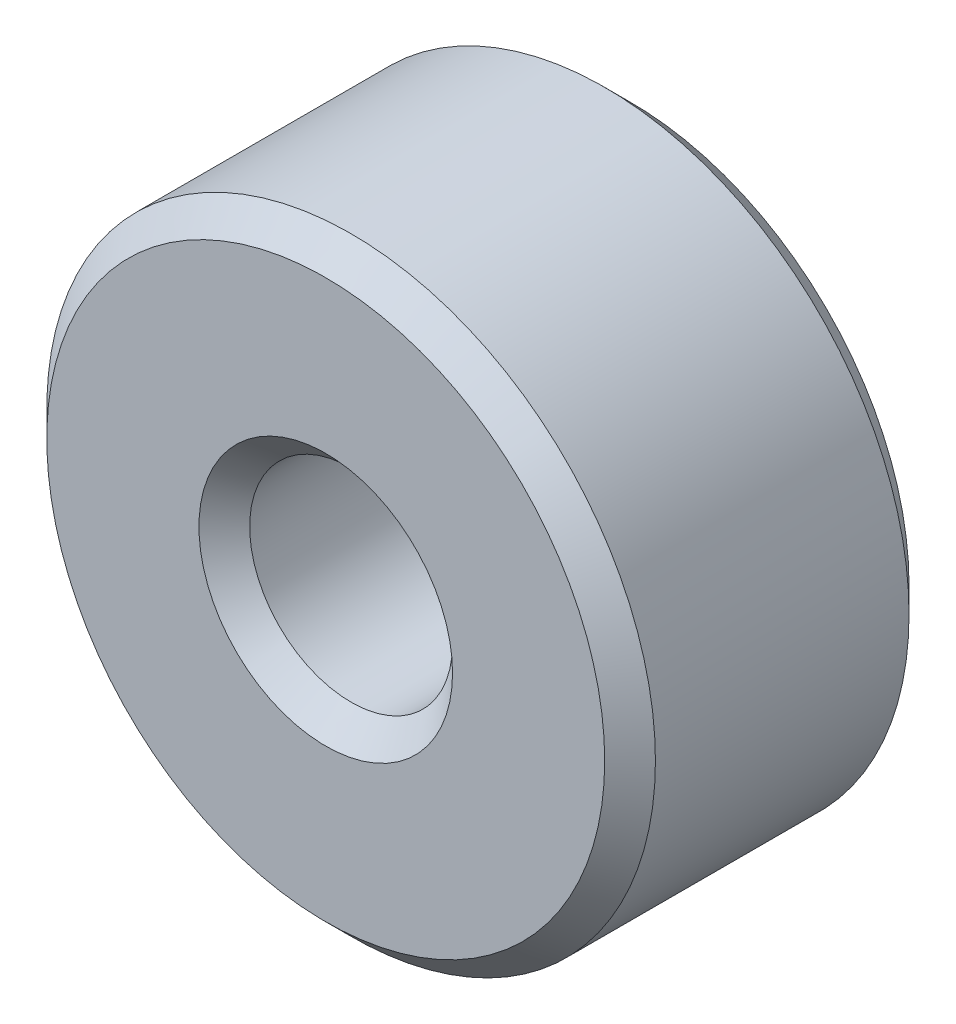
ISO-10303-21;
HEADER;
FILE_DESCRIPTION(('STEP AP214'),'2;1');
FILE_NAME('part.step','',(''),(''),'','','');
FILE_SCHEMA(('AUTOMOTIVE_DESIGN { 1 0 10303 214 1 1 1 1 }'));
ENDSEC;
DATA;
#1=APPLICATION_CONTEXT('core data for automotive mechanical design processes');
#2=APPLICATION_PROTOCOL_DEFINITION('international standard','automotive_design',2000,#1);
#3=PRODUCT_CONTEXT('',#1,'mechanical');
#4=PRODUCT('Part','Part','',(#3));
#5=PRODUCT_RELATED_PRODUCT_CATEGORY('part','',(#4));
#6=PRODUCT_DEFINITION_FORMATION('','',#4);
#7=PRODUCT_DEFINITION_CONTEXT('part definition',#1,'design');
#8=PRODUCT_DEFINITION('design','',#6,#7);
#9=PRODUCT_DEFINITION_SHAPE('','',#8);
#10=(LENGTH_UNIT() NAMED_UNIT(*) SI_UNIT(.MILLI.,.METRE.));
#11=(NAMED_UNIT(*) PLANE_ANGLE_UNIT() SI_UNIT($,.RADIAN.));
#12=(NAMED_UNIT(*) SI_UNIT($,.STERADIAN.) SOLID_ANGLE_UNIT());
#13=UNCERTAINTY_MEASURE_WITH_UNIT(LENGTH_MEASURE(1.E-05),#10,'distance_accuracy_value','');
#14=(GEOMETRIC_REPRESENTATION_CONTEXT(3) GLOBAL_UNCERTAINTY_ASSIGNED_CONTEXT((#13)) GLOBAL_UNIT_ASSIGNED_CONTEXT((#10,
#11,#12)) REPRESENTATION_CONTEXT('',''));
#15=CARTESIAN_POINT('',(0.,0.,0.));
#16=DIRECTION('',(0.,0.,1.));
#17=DIRECTION('',(1.,0.,0.));
#18=AXIS2_PLACEMENT_3D('',#15,#16,#17);
#19=CARTESIAN_POINT('',(0.,0.,3.));
#20=DIRECTION('',(0.,0.,1.));
#21=DIRECTION('',(1.,0.,0.));
#22=AXIS2_PLACEMENT_3D('',#19,#20,#21);
#23=PLANE('',#22);
#24=CARTESIAN_POINT('',(0.,0.,3.));
#25=DIRECTION('',(0.,0.,1.));
#26=DIRECTION('',(1.,0.,0.));
#27=AXIS2_PLACEMENT_3D('',#24,#25,#26);
#28=CIRCLE('',#27,1.25);
#29=CARTESIAN_POINT('',(1.25,0.,3.));
#30=VERTEX_POINT('',#29);
#31=EDGE_CURVE('E11',#30,#30,#28,.F.);
#32=ORIENTED_EDGE('',*,*,#31,.T.);
#33=EDGE_LOOP('',(#32));
#34=FACE_BOUND('',#33,.T.);
#35=CARTESIAN_POINT('',(0.,0.,3.));
#36=DIRECTION('',(0.,0.,1.));
#37=DIRECTION('',(1.,0.,0.));
#38=AXIS2_PLACEMENT_3D('',#35,#36,#37);
#39=CIRCLE('',#38,2.75);
#40=CARTESIAN_POINT('',(2.75,0.,3.));
#41=VERTEX_POINT('',#40);
#42=EDGE_CURVE('E57',#41,#41,#39,.T.);
#43=ORIENTED_EDGE('',*,*,#42,.T.);
#44=EDGE_LOOP('',(#43));
#45=FACE_BOUND('',#44,.T.);
#46=ADVANCED_FACE('F49',(#34,#45),#23,.T.);
#47=CARTESIAN_POINT('',(0.,0.,0.));
#48=DIRECTION('',(0.,0.,1.));
#49=DIRECTION('',(1.,0.,0.));
#50=AXIS2_PLACEMENT_3D('',#47,#48,#49);
#51=PLANE('',#50);
#52=CARTESIAN_POINT('',(0.,0.,0.));
#53=DIRECTION('',(0.,0.,1.));
#54=DIRECTION('',(1.,0.,0.));
#55=AXIS2_PLACEMENT_3D('',#52,#53,#54);
#56=CIRCLE('',#55,1.25);
#57=CARTESIAN_POINT('',(1.25,0.,0.));
#58=VERTEX_POINT('',#57);
#59=EDGE_CURVE('E76',#58,#58,#56,.T.);
#60=ORIENTED_EDGE('',*,*,#59,.T.);
#61=EDGE_LOOP('',(#60));
#62=FACE_BOUND('',#61,.T.);
#63=CARTESIAN_POINT('',(0.,0.,0.));
#64=DIRECTION('',(0.,0.,1.));
#65=DIRECTION('',(1.,0.,0.));
#66=AXIS2_PLACEMENT_3D('',#63,#64,#65);
#67=CIRCLE('',#66,2.75);
#68=CARTESIAN_POINT('',(2.75,0.,0.));
#69=VERTEX_POINT('',#68);
#70=EDGE_CURVE('E79',#69,#69,#67,.F.);
#71=ORIENTED_EDGE('',*,*,#70,.T.);
#72=EDGE_LOOP('',(#71));
#73=FACE_BOUND('',#72,.T.);
#74=ADVANCED_FACE('F83',(#62,#73),#51,.F.);
#75=CARTESIAN_POINT('',(0.,0.,3.));
#76=DIRECTION('',(0.,0.,-1.));
#77=DIRECTION('',(-1.,0.,0.));
#78=AXIS2_PLACEMENT_3D('',#75,#76,#77);
#79=CYLINDRICAL_SURFACE('',#78,3.);
#80=CARTESIAN_POINT('',(0.,0.,0.250000000000001));
#81=DIRECTION('',(0.,0.,1.));
#82=DIRECTION('',(1.,0.,0.));
#83=AXIS2_PLACEMENT_3D('',#80,#81,#82);
#84=CIRCLE('',#83,3.);
#85=CARTESIAN_POINT('',(3.,0.,0.250000000000001));
#86=VERTEX_POINT('',#85);
#87=EDGE_CURVE('E61',#86,#86,#84,.T.);
#88=ORIENTED_EDGE('',*,*,#87,.T.);
#89=EDGE_LOOP('',(#88));
#90=FACE_BOUND('',#89,.T.);
#91=CARTESIAN_POINT('',(0.,0.,2.75));
#92=DIRECTION('',(0.,0.,1.));
#93=DIRECTION('',(1.,0.,0.));
#94=AXIS2_PLACEMENT_3D('',#91,#92,#93);
#95=CIRCLE('',#94,3.);
#96=CARTESIAN_POINT('',(3.,0.,2.75));
#97=VERTEX_POINT('',#96);
#98=EDGE_CURVE('E65',#97,#97,#95,.F.);
#99=ORIENTED_EDGE('',*,*,#98,.T.);
#100=EDGE_LOOP('',(#99));
#101=FACE_BOUND('',#100,.T.);
#102=ADVANCED_FACE('F93',(#90,#101),#79,.T.);
#103=CARTESIAN_POINT('',(0.,0.,3.));
#104=DIRECTION('',(0.,0.,-1.));
#105=DIRECTION('',(-1.,0.,0.));
#106=AXIS2_PLACEMENT_3D('',#103,#104,#105);
#107=CYLINDRICAL_SURFACE('',#106,1.);
#108=CARTESIAN_POINT('',(0.,0.,0.250000000000001));
#109=DIRECTION('',(0.,0.,1.));
#110=DIRECTION('',(1.,0.,0.));
#111=AXIS2_PLACEMENT_3D('',#108,#109,#110);
#112=CIRCLE('',#111,1.);
#113=CARTESIAN_POINT('',(1.,0.,0.250000000000001));
#114=VERTEX_POINT('',#113);
#115=EDGE_CURVE('E70',#114,#114,#112,.F.);
#116=ORIENTED_EDGE('',*,*,#115,.T.);
#117=EDGE_LOOP('',(#116));
#118=FACE_BOUND('',#117,.T.);
#119=CARTESIAN_POINT('',(0.,0.,2.75));
#120=DIRECTION('',(0.,0.,1.));
#121=DIRECTION('',(1.,0.,0.));
#122=AXIS2_PLACEMENT_3D('',#119,#120,#121);
#123=CIRCLE('',#122,1.);
#124=CARTESIAN_POINT('',(1.,0.,2.75));
#125=VERTEX_POINT('',#124);
#126=EDGE_CURVE('E73',#125,#125,#123,.T.);
#127=ORIENTED_EDGE('',*,*,#126,.T.);
#128=EDGE_LOOP('',(#127));
#129=FACE_BOUND('',#128,.T.);
#130=ADVANCED_FACE('F96',(#118,#129),#107,.F.);
#131=CARTESIAN_POINT('',(0.,0.,0.));
#132=DIRECTION('',(0.,0.,-1.));
#133=DIRECTION('',(-1.,0.,0.));
#134=AXIS2_PLACEMENT_3D('',#131,#132,#133);
#135=CONICAL_SURFACE('',#134,1.25,0.785398163397446);
#136=ORIENTED_EDGE('',*,*,#115,.F.);
#137=EDGE_LOOP('',(#136));
#138=FACE_BOUND('',#137,.T.);
#139=ORIENTED_EDGE('',*,*,#59,.F.);
#140=EDGE_LOOP('',(#139));
#141=FACE_BOUND('',#140,.T.);
#142=ADVANCED_FACE('F89',(#138,#141),#135,.F.);
#143=CARTESIAN_POINT('',(0.,0.,0.250000000000001));
#144=DIRECTION('',(0.,0.,1.));
#145=DIRECTION('',(1.,0.,0.));
#146=AXIS2_PLACEMENT_3D('',#143,#144,#145);
#147=CONICAL_SURFACE('',#146,3.,0.78539816339745);
#148=ORIENTED_EDGE('',*,*,#70,.F.);
#149=EDGE_LOOP('',(#148));
#150=FACE_BOUND('',#149,.T.);
#151=ORIENTED_EDGE('',*,*,#87,.F.);
#152=EDGE_LOOP('',(#151));
#153=FACE_BOUND('',#152,.T.);
#154=ADVANCED_FACE('F85',(#150,#153),#147,.T.);
#155=CARTESIAN_POINT('',(0.,0.,2.75));
#156=DIRECTION('',(0.,0.,1.));
#157=DIRECTION('',(1.,0.,0.));
#158=AXIS2_PLACEMENT_3D('',#155,#156,#157);
#159=CONICAL_SURFACE('',#158,1.,0.78539816339745);
#160=ORIENTED_EDGE('',*,*,#31,.F.);
#161=EDGE_LOOP('',(#160));
#162=FACE_BOUND('',#161,.T.);
#163=ORIENTED_EDGE('',*,*,#126,.F.);
#164=EDGE_LOOP('',(#163));
#165=FACE_BOUND('',#164,.T.);
#166=ADVANCED_FACE('F88',(#162,#165),#159,.F.);
#167=CARTESIAN_POINT('',(0.,0.,3.));
#168=DIRECTION('',(0.,0.,-1.));
#169=DIRECTION('',(-1.,0.,0.));
#170=AXIS2_PLACEMENT_3D('',#167,#168,#169);
#171=CONICAL_SURFACE('',#170,2.75,0.785398163397447);
#172=ORIENTED_EDGE('',*,*,#98,.F.);
#173=EDGE_LOOP('',(#172));
#174=FACE_BOUND('',#173,.T.);
#175=ORIENTED_EDGE('',*,*,#42,.F.);
#176=EDGE_LOOP('',(#175));
#177=FACE_BOUND('',#176,.T.);
#178=ADVANCED_FACE('F52',(#174,#177),#171,.T.);
#179=CLOSED_SHELL('',(#46,#74,#102,#130,#142,#154,#166,#178));
#180=MANIFOLD_SOLID_BREP('B2',#179);
#181=ADVANCED_BREP_SHAPE_REPRESENTATION('',(#18,#180),#14);
#182=SHAPE_DEFINITION_REPRESENTATION(#9,#181);
ENDSEC;
END-ISO-10303-21;
